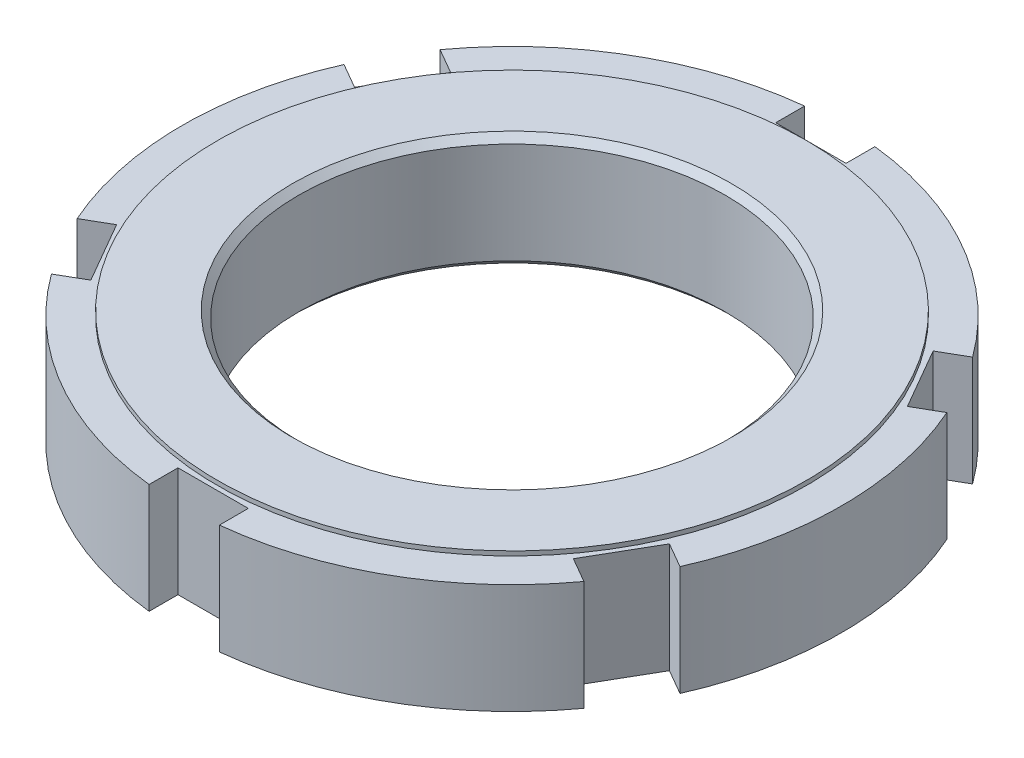
ISO-10303-21;
HEADER;
FILE_DESCRIPTION(('STEP AP214'),'2;1');
FILE_NAME('part.step','',(''),(''),'','','');
FILE_SCHEMA(('AUTOMOTIVE_DESIGN { 1 0 10303 214 1 1 1 1 }'));
ENDSEC;
DATA;
#1=APPLICATION_CONTEXT('core data for automotive mechanical design processes');
#2=APPLICATION_PROTOCOL_DEFINITION('international standard','automotive_design',2000,#1);
#3=PRODUCT_CONTEXT('',#1,'mechanical');
#4=PRODUCT('Part','Part','',(#3));
#5=PRODUCT_RELATED_PRODUCT_CATEGORY('part','',(#4));
#6=PRODUCT_DEFINITION_FORMATION('','',#4);
#7=PRODUCT_DEFINITION_CONTEXT('part definition',#1,'design');
#8=PRODUCT_DEFINITION('design','',#6,#7);
#9=PRODUCT_DEFINITION_SHAPE('','',#8);
#10=(LENGTH_UNIT() NAMED_UNIT(*) SI_UNIT(.MILLI.,.METRE.));
#11=(NAMED_UNIT(*) PLANE_ANGLE_UNIT() SI_UNIT($,.RADIAN.));
#12=(NAMED_UNIT(*) SI_UNIT($,.STERADIAN.) SOLID_ANGLE_UNIT());
#13=UNCERTAINTY_MEASURE_WITH_UNIT(LENGTH_MEASURE(1.E-05),#10,'distance_accuracy_value','');
#14=(GEOMETRIC_REPRESENTATION_CONTEXT(3) GLOBAL_UNCERTAINTY_ASSIGNED_CONTEXT((#13)) GLOBAL_UNIT_ASSIGNED_CONTEXT((#10,
#11,#12)) REPRESENTATION_CONTEXT('',''));
#15=CARTESIAN_POINT('',(0.,0.,0.));
#16=DIRECTION('',(0.,0.,1.));
#17=DIRECTION('',(1.,0.,0.));
#18=AXIS2_PLACEMENT_3D('',#15,#16,#17);
#19=CARTESIAN_POINT('',(0.,13.,0.));
#20=DIRECTION('',(0.,1.,0.));
#21=DIRECTION('',(0.,0.,1.));
#22=AXIS2_PLACEMENT_3D('',#19,#20,#21);
#23=PLANE('',#22);
#24=CARTESIAN_POINT('',(0.,13.,0.));
#25=DIRECTION('',(0.,1.,0.));
#26=DIRECTION('',(-1.,0.,0.));
#27=AXIS2_PLACEMENT_3D('',#24,#25,#26);
#28=CIRCLE('',#27,25.);
#29=CARTESIAN_POINT('',(-25.,13.,0.));
#30=VERTEX_POINT('',#29);
#31=EDGE_CURVE('E311',#30,#30,#28,.F.);
#32=ORIENTED_EDGE('',*,*,#31,.T.);
#33=EDGE_LOOP('',(#32));
#34=FACE_BOUND('',#33,.T.);
#35=CARTESIAN_POINT('',(0.,13.,0.));
#36=DIRECTION('',(0.,-1.,0.));
#37=DIRECTION('',(0.,0.,-1.));
#38=AXIS2_PLACEMENT_3D('',#35,#36,#37);
#39=CIRCLE('',#38,33.5);
#40=CARTESIAN_POINT('',(0.,13.,-33.5));
#41=VERTEX_POINT('',#40);
#42=EDGE_CURVE('E19',#41,#41,#39,.T.);
#43=ORIENTED_EDGE('',*,*,#42,.F.);
#44=EDGE_LOOP('',(#43));
#45=FACE_BOUND('',#44,.T.);
#46=ADVANCED_FACE('F16',(#34,#45),#23,.T.);
#47=CARTESIAN_POINT('',(0.,12.5,0.));
#48=DIRECTION('',(0.,-1.,0.));
#49=DIRECTION('',(0.,0.,-1.));
#50=AXIS2_PLACEMENT_3D('',#47,#48,#49);
#51=CYLINDRICAL_SURFACE('',#50,33.5);
#52=CARTESIAN_POINT('',(0.,12.5,0.));
#53=DIRECTION('',(0.,-1.,0.));
#54=DIRECTION('',(0.,0.,-1.));
#55=AXIS2_PLACEMENT_3D('',#52,#53,#54);
#56=CIRCLE('',#55,33.5);
#57=CARTESIAN_POINT('',(0.,12.5,-33.5));
#58=VERTEX_POINT('',#57);
#59=EDGE_CURVE('E268',#58,#58,#56,.T.);
#60=ORIENTED_EDGE('',*,*,#59,.F.);
#61=EDGE_LOOP('',(#60));
#62=FACE_BOUND('',#61,.T.);
#63=ORIENTED_EDGE('',*,*,#42,.T.);
#64=EDGE_LOOP('',(#63));
#65=FACE_BOUND('',#64,.T.);
#66=ADVANCED_FACE('F318',(#62,#65),#51,.T.);
#67=CARTESIAN_POINT('',(0.,13.,0.));
#68=DIRECTION('',(0.,1.,0.));
#69=DIRECTION('',(-1.,0.,0.));
#70=AXIS2_PLACEMENT_3D('',#67,#68,#69);
#71=CONICAL_SURFACE('',#70,25.,0.785398163397444);
#72=CARTESIAN_POINT('',(0.,12.25,0.));
#73=DIRECTION('',(0.,1.,0.));
#74=DIRECTION('',(0.,0.,1.));
#75=AXIS2_PLACEMENT_3D('',#72,#73,#74);
#76=CIRCLE('',#75,24.25);
#77=CARTESIAN_POINT('',(0.,12.25,24.25));
#78=VERTEX_POINT('',#77);
#79=EDGE_CURVE('E150',#78,#78,#76,.F.);
#80=ORIENTED_EDGE('',*,*,#79,.T.);
#81=EDGE_LOOP('',(#80));
#82=FACE_BOUND('',#81,.T.);
#83=ORIENTED_EDGE('',*,*,#31,.F.);
#84=EDGE_LOOP('',(#83));
#85=FACE_BOUND('',#84,.T.);
#86=ADVANCED_FACE('F325',(#82,#85),#71,.F.);
#87=CARTESIAN_POINT('',(0.,12.5,0.));
#88=DIRECTION('',(0.,1.,0.));
#89=DIRECTION('',(0.,0.,1.));
#90=AXIS2_PLACEMENT_3D('',#87,#88,#89);
#91=PLANE('',#90);
#92=ORIENTED_EDGE('',*,*,#59,.T.);
#93=EDGE_LOOP('',(#92));
#94=FACE_BOUND('',#93,.T.);
#95=DIRECTION('',(-0.866025403784439,0.,0.499999999999999));
#96=VECTOR('',#95,1.);
#97=CARTESIAN_POINT('',(30.2906720276925,12.5,-22.1071298026399));
#98=LINE('',#97,#96);
#99=CARTESIAN_POINT('',(27.4448637286709,12.5,-20.4641016151378));
#100=VERTEX_POINT('',#99);
#101=CARTESIAN_POINT('',(30.2906720276925,12.5,-22.1071298026399));
#102=VERTEX_POINT('',#101);
#103=EDGE_CURVE('E171',#100,#102,#98,.F.);
#104=ORIENTED_EDGE('',*,*,#103,.T.);
#105=CARTESIAN_POINT('',(0.,12.5,0.));
#106=DIRECTION('',(0.,1.,0.));
#107=DIRECTION('',(0.,0.,1.));
#108=AXIS2_PLACEMENT_3D('',#105,#106,#107);
#109=CIRCLE('',#108,37.5);
#110=CARTESIAN_POINT('',(4.00000000000002,12.5,-37.2860563750043));
#111=VERTEX_POINT('',#110);
#112=EDGE_CURVE('E158',#111,#102,#109,.F.);
#113=ORIENTED_EDGE('',*,*,#112,.F.);
#114=DIRECTION('',(0.,0.,-1.));
#115=VECTOR('',#114,1.);
#116=CARTESIAN_POINT('',(4.00000000000002,12.5,-37.2860563750043));
#117=LINE('',#116,#115);
#118=CARTESIAN_POINT('',(4.00000000000001,12.5,-34.));
#119=VERTEX_POINT('',#118);
#120=EDGE_CURVE('E153',#111,#119,#117,.F.);
#121=ORIENTED_EDGE('',*,*,#120,.T.);
#122=DIRECTION('',(1.,0.,0.));
#123=VECTOR('',#122,1.);
#124=CARTESIAN_POINT('',(-4.00000000000001,12.5,-34.));
#125=LINE('',#124,#123);
#126=CARTESIAN_POINT('',(-4.00000000000001,12.5,-34.));
#127=VERTEX_POINT('',#126);
#128=EDGE_CURVE('E138',#119,#127,#125,.F.);
#129=ORIENTED_EDGE('',*,*,#128,.T.);
#130=DIRECTION('',(0.,0.,1.));
#131=VECTOR('',#130,1.);
#132=CARTESIAN_POINT('',(-4.00000000000001,12.5,-37.2860563750043));
#133=LINE('',#132,#131);
#134=CARTESIAN_POINT('',(-4.,12.5,-37.2860563750043));
#135=VERTEX_POINT('',#134);
#136=EDGE_CURVE('E263',#127,#135,#133,.F.);
#137=ORIENTED_EDGE('',*,*,#136,.T.);
#138=CARTESIAN_POINT('',(0.,12.5,0.));
#139=DIRECTION('',(0.,1.,0.));
#140=DIRECTION('',(0.,0.,1.));
#141=AXIS2_PLACEMENT_3D('',#138,#139,#140);
#142=CIRCLE('',#141,37.5);
#143=CARTESIAN_POINT('',(-30.2906720276925,12.5,-22.1071298026399));
#144=VERTEX_POINT('',#143);
#145=EDGE_CURVE('E128',#144,#135,#142,.F.);
#146=ORIENTED_EDGE('',*,*,#145,.F.);
#147=DIRECTION('',(-0.866025403784434,0.,-0.500000000000007));
#148=VECTOR('',#147,1.);
#149=CARTESIAN_POINT('',(-30.2906720276925,12.5,-22.1071298026399));
#150=LINE('',#149,#148);
#151=CARTESIAN_POINT('',(-27.4448637286709,12.5,-20.4641016151377));
#152=VERTEX_POINT('',#151);
#153=EDGE_CURVE('E258',#144,#152,#150,.F.);
#154=ORIENTED_EDGE('',*,*,#153,.T.);
#155=DIRECTION('',(0.499999999999999,0.,-0.866025403784439));
#156=VECTOR('',#155,1.);
#157=CARTESIAN_POINT('',(-31.4448637286709,12.5,-13.5358983848622));
#158=LINE('',#157,#156);
#159=CARTESIAN_POINT('',(-31.4448637286709,12.5,-13.5358983848622));
#160=VERTEX_POINT('',#159);
#161=EDGE_CURVE('E252',#152,#160,#158,.F.);
#162=ORIENTED_EDGE('',*,*,#161,.T.);
#163=DIRECTION('',(0.866025403784439,0.,0.499999999999999));
#164=VECTOR('',#163,1.);
#165=CARTESIAN_POINT('',(-34.2906720276925,12.5,-15.1789265723644));
#166=LINE('',#165,#164);
#167=CARTESIAN_POINT('',(-34.2906720276925,12.5,-15.1789265723644));
#168=VERTEX_POINT('',#167);
#169=EDGE_CURVE('E245',#160,#168,#166,.F.);
#170=ORIENTED_EDGE('',*,*,#169,.T.);
#171=CARTESIAN_POINT('',(0.,12.5,0.));
#172=DIRECTION('',(0.,1.,0.));
#173=DIRECTION('',(0.,0.,1.));
#174=AXIS2_PLACEMENT_3D('',#171,#172,#173);
#175=CIRCLE('',#174,37.5);
#176=CARTESIAN_POINT('',(-34.2906720276925,12.5,15.1789265723644));
#177=VERTEX_POINT('',#176);
#178=EDGE_CURVE('E248',#177,#168,#175,.F.);
#179=ORIENTED_EDGE('',*,*,#178,.F.);
#180=DIRECTION('',(-0.866025403784444,0.,0.499999999999992));
#181=VECTOR('',#180,1.);
#182=CARTESIAN_POINT('',(-34.2906720276925,12.5,15.1789265723644));
#183=LINE('',#182,#181);
#184=CARTESIAN_POINT('',(-31.4448637286709,12.5,13.5358983848623));
#185=VERTEX_POINT('',#184);
#186=EDGE_CURVE('E239',#177,#185,#183,.F.);
#187=ORIENTED_EDGE('',*,*,#186,.T.);
#188=DIRECTION('',(-0.500000000000001,0.,-0.866025403784438));
#189=VECTOR('',#188,1.);
#190=CARTESIAN_POINT('',(-27.4448637286709,12.5,20.4641016151378));
#191=LINE('',#190,#189);
#192=CARTESIAN_POINT('',(-27.4448637286709,12.5,20.4641016151378));
#193=VERTEX_POINT('',#192);
#194=EDGE_CURVE('E233',#185,#193,#191,.F.);
#195=ORIENTED_EDGE('',*,*,#194,.T.);
#196=DIRECTION('',(0.866025403784438,0.,-0.500000000000001));
#197=VECTOR('',#196,1.);
#198=CARTESIAN_POINT('',(-30.2906720276924,12.5,22.1071298026399));
#199=LINE('',#198,#197);
#200=CARTESIAN_POINT('',(-30.2906720276925,12.5,22.1071298026399));
#201=VERTEX_POINT('',#200);
#202=EDGE_CURVE('E226',#193,#201,#199,.F.);
#203=ORIENTED_EDGE('',*,*,#202,.T.);
#204=CARTESIAN_POINT('',(0.,12.5,0.));
#205=DIRECTION('',(0.,1.,0.));
#206=DIRECTION('',(0.,0.,1.));
#207=AXIS2_PLACEMENT_3D('',#204,#205,#206);
#208=CIRCLE('',#207,37.5);
#209=CARTESIAN_POINT('',(-4.00000000000002,12.5,37.2860563750043));
#210=VERTEX_POINT('',#209);
#211=EDGE_CURVE('E229',#210,#201,#208,.F.);
#212=ORIENTED_EDGE('',*,*,#211,.F.);
#213=DIRECTION('',(0.,0.,1.));
#214=VECTOR('',#213,1.);
#215=CARTESIAN_POINT('',(-4.00000000000002,12.5,37.2860563750043));
#216=LINE('',#215,#214);
#217=CARTESIAN_POINT('',(-3.99999999999999,12.5,34.));
#218=VERTEX_POINT('',#217);
#219=EDGE_CURVE('E220',#210,#218,#216,.F.);
#220=ORIENTED_EDGE('',*,*,#219,.T.);
#221=DIRECTION('',(-1.,0.,0.));
#222=VECTOR('',#221,1.);
#223=CARTESIAN_POINT('',(4.00000000000001,12.5,34.));
#224=LINE('',#223,#222);
#225=CARTESIAN_POINT('',(4.00000000000001,12.5,34.));
#226=VERTEX_POINT('',#225);
#227=EDGE_CURVE('E214',#218,#226,#224,.F.);
#228=ORIENTED_EDGE('',*,*,#227,.T.);
#229=DIRECTION('',(0.,0.,-1.));
#230=VECTOR('',#229,1.);
#231=CARTESIAN_POINT('',(4.00000000000002,12.5,37.2860563750043));
#232=LINE('',#231,#230);
#233=CARTESIAN_POINT('',(4.00000000000002,12.5,37.2860563750043));
#234=VERTEX_POINT('',#233);
#235=EDGE_CURVE('E207',#226,#234,#232,.F.);
#236=ORIENTED_EDGE('',*,*,#235,.T.);
#237=CARTESIAN_POINT('',(0.,12.5,0.));
#238=DIRECTION('',(0.,1.,0.));
#239=DIRECTION('',(0.,0.,1.));
#240=AXIS2_PLACEMENT_3D('',#237,#238,#239);
#241=CIRCLE('',#240,37.5);
#242=CARTESIAN_POINT('',(30.2906720276925,12.5,22.1071298026399));
#243=VERTEX_POINT('',#242);
#244=EDGE_CURVE('E210',#243,#234,#241,.F.);
#245=ORIENTED_EDGE('',*,*,#244,.F.);
#246=DIRECTION('',(0.866025403784434,0.,0.500000000000008));
#247=VECTOR('',#246,1.);
#248=CARTESIAN_POINT('',(30.2906720276925,12.5,22.1071298026399));
#249=LINE('',#248,#247);
#250=CARTESIAN_POINT('',(27.4448637286709,12.5,20.4641016151377));
#251=VERTEX_POINT('',#250);
#252=EDGE_CURVE('E201',#243,#251,#249,.F.);
#253=ORIENTED_EDGE('',*,*,#252,.T.);
#254=DIRECTION('',(-0.5,0.,0.866025403784439));
#255=VECTOR('',#254,1.);
#256=CARTESIAN_POINT('',(31.4448637286709,12.5,13.5358983848622));
#257=LINE('',#256,#255);
#258=CARTESIAN_POINT('',(31.4448637286709,12.5,13.5358983848622));
#259=VERTEX_POINT('',#258);
#260=EDGE_CURVE('E195',#251,#259,#257,.F.);
#261=ORIENTED_EDGE('',*,*,#260,.T.);
#262=DIRECTION('',(-0.866025403784439,0.,-0.499999999999999));
#263=VECTOR('',#262,1.);
#264=CARTESIAN_POINT('',(34.2906720276925,12.5,15.1789265723644));
#265=LINE('',#264,#263);
#266=CARTESIAN_POINT('',(34.2906720276925,12.5,15.1789265723644));
#267=VERTEX_POINT('',#266);
#268=EDGE_CURVE('E188',#259,#267,#265,.F.);
#269=ORIENTED_EDGE('',*,*,#268,.T.);
#270=CARTESIAN_POINT('',(0.,12.5,0.));
#271=DIRECTION('',(0.,1.,0.));
#272=DIRECTION('',(0.,0.,1.));
#273=AXIS2_PLACEMENT_3D('',#270,#271,#272);
#274=CIRCLE('',#273,37.5);
#275=CARTESIAN_POINT('',(34.2906720276925,12.5,-15.1789265723644));
#276=VERTEX_POINT('',#275);
#277=EDGE_CURVE('E191',#276,#267,#274,.F.);
#278=ORIENTED_EDGE('',*,*,#277,.F.);
#279=DIRECTION('',(0.866025403784444,0.,-0.49999999999999));
#280=VECTOR('',#279,1.);
#281=CARTESIAN_POINT('',(34.2906720276925,12.5,-15.1789265723644));
#282=LINE('',#281,#280);
#283=CARTESIAN_POINT('',(31.4448637286709,12.5,-13.5358983848623));
#284=VERTEX_POINT('',#283);
#285=EDGE_CURVE('E182',#276,#284,#282,.F.);
#286=ORIENTED_EDGE('',*,*,#285,.T.);
#287=DIRECTION('',(0.5,0.,0.866025403784439));
#288=VECTOR('',#287,1.);
#289=CARTESIAN_POINT('',(27.4448637286709,12.5,-20.4641016151378));
#290=LINE('',#289,#288);
#291=EDGE_CURVE('E176',#284,#100,#290,.F.);
#292=ORIENTED_EDGE('',*,*,#291,.T.);
#293=EDGE_LOOP('',(#104,#113,#121,#129,#137,#146,#154,#162,#170,#179,#187,#195,#203,#212,#220,
#228,#236,#245,#253,#261,#269,#278,#286,#292));
#294=FACE_BOUND('',#293,.T.);
#295=ADVANCED_FACE('F157',(#94,#294),#91,.T.);
#296=CARTESIAN_POINT('',(0.,13.,0.));
#297=DIRECTION('',(0.,1.,0.));
#298=DIRECTION('',(0.,0.,1.));
#299=AXIS2_PLACEMENT_3D('',#296,#297,#298);
#300=CYLINDRICAL_SURFACE('',#299,24.25);
#301=ORIENTED_EDGE('',*,*,#79,.F.);
#302=EDGE_LOOP('',(#301));
#303=FACE_BOUND('',#302,.T.);
#304=CARTESIAN_POINT('',(0.,0.749999999999994,0.));
#305=DIRECTION('',(0.,-1.,0.));
#306=DIRECTION('',(0.,0.,-1.));
#307=AXIS2_PLACEMENT_3D('',#304,#305,#306);
#308=CIRCLE('',#307,24.25);
#309=CARTESIAN_POINT('',(0.,0.749999999999992,-24.25));
#310=VERTEX_POINT('',#309);
#311=EDGE_CURVE('E159',#310,#310,#308,.T.);
#312=ORIENTED_EDGE('',*,*,#311,.T.);
#313=EDGE_LOOP('',(#312));
#314=FACE_BOUND('',#313,.T.);
#315=ADVANCED_FACE('F431',(#303,#314),#300,.F.);
#316=CARTESIAN_POINT('',(-4.00000000000001,13.,-34.));
#317=DIRECTION('',(0.,0.,1.));
#318=DIRECTION('',(1.,0.,0.));
#319=AXIS2_PLACEMENT_3D('',#316,#317,#318);
#320=PLANE('',#319);
#321=DIRECTION('',(0.,1.,0.));
#322=VECTOR('',#321,1.);
#323=CARTESIAN_POINT('',(4.00000000000002,13.,-34.));
#324=LINE('',#323,#322);
#325=CARTESIAN_POINT('',(4.00000000000002,0.,-34.));
#326=VERTEX_POINT('',#325);
#327=EDGE_CURVE('E147',#119,#326,#324,.F.);
#328=ORIENTED_EDGE('',*,*,#327,.T.);
#329=DIRECTION('',(1.,0.,0.));
#330=VECTOR('',#329,1.);
#331=CARTESIAN_POINT('',(0.,0.,-34.));
#332=LINE('',#331,#330);
#333=CARTESIAN_POINT('',(-4.00000000000001,0.,-34.));
#334=VERTEX_POINT('',#333);
#335=EDGE_CURVE('E162',#326,#334,#332,.F.);
#336=ORIENTED_EDGE('',*,*,#335,.T.);
#337=DIRECTION('',(0.,1.,0.));
#338=VECTOR('',#337,1.);
#339=CARTESIAN_POINT('',(-4.00000000000001,13.,-34.));
#340=LINE('',#339,#338);
#341=EDGE_CURVE('E149',#334,#127,#340,.T.);
#342=ORIENTED_EDGE('',*,*,#341,.T.);
#343=ORIENTED_EDGE('',*,*,#128,.F.);
#344=EDGE_LOOP('',(#328,#336,#342,#343));
#345=FACE_BOUND('',#344,.T.);
#346=ADVANCED_FACE('F145',(#345),#320,.F.);
#347=CARTESIAN_POINT('',(-4.00000000000001,13.,-37.2860563750043));
#348=DIRECTION('',(-1.,0.,0.));
#349=DIRECTION('',(0.,0.,1.));
#350=AXIS2_PLACEMENT_3D('',#347,#348,#349);
#351=PLANE('',#350);
#352=ORIENTED_EDGE('',*,*,#341,.F.);
#353=DIRECTION('',(0.,0.,1.));
#354=VECTOR('',#353,1.);
#355=CARTESIAN_POINT('',(-4.00000000000001,0.,0.));
#356=LINE('',#355,#354);
#357=CARTESIAN_POINT('',(-4.,0.,-37.2860563750043));
#358=VERTEX_POINT('',#357);
#359=EDGE_CURVE('E298',#334,#358,#356,.F.);
#360=ORIENTED_EDGE('',*,*,#359,.T.);
#361=DIRECTION('',(0.,1.,0.));
#362=VECTOR('',#361,1.);
#363=CARTESIAN_POINT('',(-3.99999999999999,13.,-37.2860563750043));
#364=LINE('',#363,#362);
#365=EDGE_CURVE('E309',#135,#358,#364,.F.);
#366=ORIENTED_EDGE('',*,*,#365,.F.);
#367=ORIENTED_EDGE('',*,*,#136,.F.);
#368=EDGE_LOOP('',(#352,#360,#366,#367));
#369=FACE_BOUND('',#368,.T.);
#370=ADVANCED_FACE('F425',(#369),#351,.F.);
#371=CARTESIAN_POINT('',(0.,13.,0.));
#372=DIRECTION('',(0.,1.,0.));
#373=DIRECTION('',(0.,0.,1.));
#374=AXIS2_PLACEMENT_3D('',#371,#372,#373);
#375=CYLINDRICAL_SURFACE('',#374,37.5);
#376=CARTESIAN_POINT('',(0.,0.,0.));
#377=DIRECTION('',(0.,1.,0.));
#378=DIRECTION('',(0.,0.,1.));
#379=AXIS2_PLACEMENT_3D('',#376,#377,#378);
#380=CIRCLE('',#379,37.5);
#381=CARTESIAN_POINT('',(-30.2906720276925,0.,-22.1071298026399));
#382=VERTEX_POINT('',#381);
#383=EDGE_CURVE('E294',#358,#382,#380,.T.);
#384=ORIENTED_EDGE('',*,*,#383,.T.);
#385=DIRECTION('',(0.,1.,0.));
#386=VECTOR('',#385,1.);
#387=CARTESIAN_POINT('',(-30.2906720276925,13.,-22.1071298026399));
#388=LINE('',#387,#386);
#389=EDGE_CURVE('E260',#382,#144,#388,.T.);
#390=ORIENTED_EDGE('',*,*,#389,.T.);
#391=ORIENTED_EDGE('',*,*,#145,.T.);
#392=ORIENTED_EDGE('',*,*,#365,.T.);
#393=EDGE_LOOP('',(#384,#390,#391,#392));
#394=FACE_BOUND('',#393,.T.);
#395=ADVANCED_FACE('F421',(#394),#375,.T.);
#396=CARTESIAN_POINT('',(-30.2906720276925,13.,-22.1071298026399));
#397=DIRECTION('',(0.500000000000007,0.,-0.866025403784434));
#398=DIRECTION('',(-0.866025403784434,0.,-0.500000000000007));
#399=AXIS2_PLACEMENT_3D('',#396,#397,#398);
#400=PLANE('',#399);
#401=ORIENTED_EDGE('',*,*,#389,.F.);
#402=DIRECTION('',(0.866025403784436,0.,0.500000000000004));
#403=VECTOR('',#402,1.);
#404=CARTESIAN_POINT('',(-30.2906720276925,0.,-22.1071298026399));
#405=LINE('',#404,#403);
#406=CARTESIAN_POINT('',(-27.4448637286709,0.,-20.4641016151377));
#407=VERTEX_POINT('',#406);
#408=EDGE_CURVE('E297',#382,#407,#405,.T.);
#409=ORIENTED_EDGE('',*,*,#408,.T.);
#410=DIRECTION('',(0.,1.,0.));
#411=VECTOR('',#410,1.);
#412=CARTESIAN_POINT('',(-27.4448637286709,13.,-20.4641016151377));
#413=LINE('',#412,#411);
#414=EDGE_CURVE('E255',#407,#152,#413,.T.);
#415=ORIENTED_EDGE('',*,*,#414,.T.);
#416=ORIENTED_EDGE('',*,*,#153,.F.);
#417=EDGE_LOOP('',(#401,#409,#415,#416));
#418=FACE_BOUND('',#417,.T.);
#419=ADVANCED_FACE('F417',(#418),#400,.F.);
#420=CARTESIAN_POINT('',(-31.4448637286709,13.,-13.5358983848622));
#421=DIRECTION('',(0.866025403784439,0.,0.499999999999999));
#422=DIRECTION('',(0.499999999999999,0.,-0.866025403784439));
#423=AXIS2_PLACEMENT_3D('',#420,#421,#422);
#424=PLANE('',#423);
#425=ORIENTED_EDGE('',*,*,#414,.F.);
#426=DIRECTION('',(-0.499999999999999,0.,0.866025403784439));
#427=VECTOR('',#426,1.);
#428=CARTESIAN_POINT('',(-27.4448637286709,0.,-20.4641016151377));
#429=LINE('',#428,#427);
#430=CARTESIAN_POINT('',(-31.4448637286709,0.,-13.5358983848622));
#431=VERTEX_POINT('',#430);
#432=EDGE_CURVE('E920',#407,#431,#429,.T.);
#433=ORIENTED_EDGE('',*,*,#432,.T.);
#434=DIRECTION('',(0.,1.,0.));
#435=VECTOR('',#434,1.);
#436=CARTESIAN_POINT('',(-31.4448637286709,13.,-13.5358983848622));
#437=LINE('',#436,#435);
#438=EDGE_CURVE('E249',#431,#160,#437,.T.);
#439=ORIENTED_EDGE('',*,*,#438,.T.);
#440=ORIENTED_EDGE('',*,*,#161,.F.);
#441=EDGE_LOOP('',(#425,#433,#439,#440));
#442=FACE_BOUND('',#441,.T.);
#443=ADVANCED_FACE('F413',(#442),#424,.F.);
#444=CARTESIAN_POINT('',(-34.2906720276925,13.,-15.1789265723644));
#445=DIRECTION('',(-0.499999999999999,0.,0.866025403784439));
#446=DIRECTION('',(0.866025403784439,0.,0.499999999999999));
#447=AXIS2_PLACEMENT_3D('',#444,#445,#446);
#448=PLANE('',#447);
#449=ORIENTED_EDGE('',*,*,#438,.F.);
#450=DIRECTION('',(-0.866025403784439,0.,-0.499999999999999));
#451=VECTOR('',#450,1.);
#452=CARTESIAN_POINT('',(-31.4448637286709,0.,-13.5358983848622));
#453=LINE('',#452,#451);
#454=CARTESIAN_POINT('',(-34.2906720276925,0.,-15.1789265723644));
#455=VERTEX_POINT('',#454);
#456=EDGE_CURVE('E293',#431,#455,#453,.T.);
#457=ORIENTED_EDGE('',*,*,#456,.T.);
#458=DIRECTION('',(0.,1.,0.));
#459=VECTOR('',#458,1.);
#460=CARTESIAN_POINT('',(-34.2906720276925,13.,-15.1789265723644));
#461=LINE('',#460,#459);
#462=EDGE_CURVE('E307',#168,#455,#461,.F.);
#463=ORIENTED_EDGE('',*,*,#462,.F.);
#464=ORIENTED_EDGE('',*,*,#169,.F.);
#465=EDGE_LOOP('',(#449,#457,#463,#464));
#466=FACE_BOUND('',#465,.T.);
#467=ADVANCED_FACE('F409',(#466),#448,.F.);
#468=CARTESIAN_POINT('',(0.,13.,0.));
#469=DIRECTION('',(0.,1.,0.));
#470=DIRECTION('',(0.,0.,1.));
#471=AXIS2_PLACEMENT_3D('',#468,#469,#470);
#472=CYLINDRICAL_SURFACE('',#471,37.5);
#473=CARTESIAN_POINT('',(0.,0.,0.));
#474=DIRECTION('',(0.,1.,0.));
#475=DIRECTION('',(0.,0.,1.));
#476=AXIS2_PLACEMENT_3D('',#473,#474,#475);
#477=CIRCLE('',#476,37.5);
#478=CARTESIAN_POINT('',(-34.2906720276925,0.,15.1789265723644));
#479=VERTEX_POINT('',#478);
#480=EDGE_CURVE('E289',#455,#479,#477,.T.);
#481=ORIENTED_EDGE('',*,*,#480,.T.);
#482=DIRECTION('',(0.,1.,0.));
#483=VECTOR('',#482,1.);
#484=CARTESIAN_POINT('',(-34.2906720276925,13.,15.1789265723644));
#485=LINE('',#484,#483);
#486=EDGE_CURVE('E242',#479,#177,#485,.T.);
#487=ORIENTED_EDGE('',*,*,#486,.T.);
#488=ORIENTED_EDGE('',*,*,#178,.T.);
#489=ORIENTED_EDGE('',*,*,#462,.T.);
#490=EDGE_LOOP('',(#481,#487,#488,#489));
#491=FACE_BOUND('',#490,.T.);
#492=ADVANCED_FACE('F405',(#491),#472,.T.);
#493=CARTESIAN_POINT('',(-34.2906720276925,13.,15.1789265723644));
#494=DIRECTION('',(-0.499999999999992,0.,-0.866025403784444));
#495=DIRECTION('',(-0.866025403784444,0.,0.499999999999992));
#496=AXIS2_PLACEMENT_3D('',#493,#494,#495);
#497=PLANE('',#496);
#498=ORIENTED_EDGE('',*,*,#486,.F.);
#499=DIRECTION('',(0.866025403784446,0.,-0.499999999999987));
#500=VECTOR('',#499,1.);
#501=CARTESIAN_POINT('',(-34.2906720276925,0.,15.1789265723644));
#502=LINE('',#501,#500);
#503=CARTESIAN_POINT('',(-31.4448637286709,0.,13.5358983848623));
#504=VERTEX_POINT('',#503);
#505=EDGE_CURVE('E292',#479,#504,#502,.T.);
#506=ORIENTED_EDGE('',*,*,#505,.T.);
#507=DIRECTION('',(0.,1.,0.));
#508=VECTOR('',#507,1.);
#509=CARTESIAN_POINT('',(-31.4448637286709,13.,13.5358983848623));
#510=LINE('',#509,#508);
#511=EDGE_CURVE('E236',#504,#185,#510,.T.);
#512=ORIENTED_EDGE('',*,*,#511,.T.);
#513=ORIENTED_EDGE('',*,*,#186,.F.);
#514=EDGE_LOOP('',(#498,#506,#512,#513));
#515=FACE_BOUND('',#514,.T.);
#516=ADVANCED_FACE('F401',(#515),#497,.F.);
#517=CARTESIAN_POINT('',(-27.4448637286709,13.,20.4641016151378));
#518=DIRECTION('',(0.866025403784438,0.,-0.500000000000001));
#519=DIRECTION('',(-0.500000000000001,0.,-0.866025403784438));
#520=AXIS2_PLACEMENT_3D('',#517,#518,#519);
#521=PLANE('',#520);
#522=ORIENTED_EDGE('',*,*,#511,.F.);
#523=DIRECTION('',(0.5,0.,0.866025403784439));
#524=VECTOR('',#523,1.);
#525=CARTESIAN_POINT('',(-31.4448637286709,0.,13.5358983848623));
#526=LINE('',#525,#524);
#527=CARTESIAN_POINT('',(-27.4448637286709,0.,20.4641016151378));
#528=VERTEX_POINT('',#527);
#529=EDGE_CURVE('E904',#504,#528,#526,.T.);
#530=ORIENTED_EDGE('',*,*,#529,.T.);
#531=DIRECTION('',(0.,1.,0.));
#532=VECTOR('',#531,1.);
#533=CARTESIAN_POINT('',(-27.4448637286709,13.,20.4641016151378));
#534=LINE('',#533,#532);
#535=EDGE_CURVE('E230',#528,#193,#534,.T.);
#536=ORIENTED_EDGE('',*,*,#535,.T.);
#537=ORIENTED_EDGE('',*,*,#194,.F.);
#538=EDGE_LOOP('',(#522,#530,#536,#537));
#539=FACE_BOUND('',#538,.T.);
#540=ADVANCED_FACE('F397',(#539),#521,.F.);
#541=CARTESIAN_POINT('',(-30.2906720276924,13.,22.1071298026399));
#542=DIRECTION('',(0.500000000000001,0.,0.866025403784438));
#543=DIRECTION('',(0.866025403784438,0.,-0.500000000000001));
#544=AXIS2_PLACEMENT_3D('',#541,#542,#543);
#545=PLANE('',#544);
#546=ORIENTED_EDGE('',*,*,#535,.F.);
#547=DIRECTION('',(-0.866025403784438,0.,0.500000000000001));
#548=VECTOR('',#547,1.);
#549=CARTESIAN_POINT('',(-27.4448637286709,0.,20.4641016151378));
#550=LINE('',#549,#548);
#551=CARTESIAN_POINT('',(-30.2906720276925,0.,22.1071298026399));
#552=VERTEX_POINT('',#551);
#553=EDGE_CURVE('E288',#528,#552,#550,.T.);
#554=ORIENTED_EDGE('',*,*,#553,.T.);
#555=DIRECTION('',(0.,1.,0.));
#556=VECTOR('',#555,1.);
#557=CARTESIAN_POINT('',(-30.2906720276925,13.,22.1071298026399));
#558=LINE('',#557,#556);
#559=EDGE_CURVE('E305',#201,#552,#558,.F.);
#560=ORIENTED_EDGE('',*,*,#559,.F.);
#561=ORIENTED_EDGE('',*,*,#202,.F.);
#562=EDGE_LOOP('',(#546,#554,#560,#561));
#563=FACE_BOUND('',#562,.T.);
#564=ADVANCED_FACE('F393',(#563),#545,.F.);
#565=CARTESIAN_POINT('',(0.,13.,0.));
#566=DIRECTION('',(0.,1.,0.));
#567=DIRECTION('',(0.,0.,1.));
#568=AXIS2_PLACEMENT_3D('',#565,#566,#567);
#569=CYLINDRICAL_SURFACE('',#568,37.5);
#570=CARTESIAN_POINT('',(0.,0.,0.));
#571=DIRECTION('',(0.,1.,0.));
#572=DIRECTION('',(0.,0.,1.));
#573=AXIS2_PLACEMENT_3D('',#570,#571,#572);
#574=CIRCLE('',#573,37.5);
#575=CARTESIAN_POINT('',(-4.00000000000003,0.,37.2860563750043));
#576=VERTEX_POINT('',#575);
#577=EDGE_CURVE('E284',#552,#576,#574,.T.);
#578=ORIENTED_EDGE('',*,*,#577,.T.);
#579=DIRECTION('',(0.,1.,0.));
#580=VECTOR('',#579,1.);
#581=CARTESIAN_POINT('',(-4.00000000000002,13.,37.2860563750043));
#582=LINE('',#581,#580);
#583=EDGE_CURVE('E223',#576,#210,#582,.T.);
#584=ORIENTED_EDGE('',*,*,#583,.T.);
#585=ORIENTED_EDGE('',*,*,#211,.T.);
#586=ORIENTED_EDGE('',*,*,#559,.T.);
#587=EDGE_LOOP('',(#578,#584,#585,#586));
#588=FACE_BOUND('',#587,.T.);
#589=ADVANCED_FACE('F389',(#588),#569,.T.);
#590=CARTESIAN_POINT('',(-4.00000000000002,13.,37.2860563750043));
#591=DIRECTION('',(-1.,0.,0.));
#592=DIRECTION('',(0.,0.,1.));
#593=AXIS2_PLACEMENT_3D('',#590,#591,#592);
#594=PLANE('',#593);
#595=ORIENTED_EDGE('',*,*,#583,.F.);
#596=DIRECTION('',(0.,0.,1.));
#597=VECTOR('',#596,1.);
#598=CARTESIAN_POINT('',(-4.00000000000004,0.,0.));
#599=LINE('',#598,#597);
#600=CARTESIAN_POINT('',(-4.00000000000002,0.,34.));
#601=VERTEX_POINT('',#600);
#602=EDGE_CURVE('E287',#576,#601,#599,.F.);
#603=ORIENTED_EDGE('',*,*,#602,.T.);
#604=DIRECTION('',(0.,1.,0.));
#605=VECTOR('',#604,1.);
#606=CARTESIAN_POINT('',(-3.99999999999999,13.,34.));
#607=LINE('',#606,#605);
#608=EDGE_CURVE('E217',#601,#218,#607,.T.);
#609=ORIENTED_EDGE('',*,*,#608,.T.);
#610=ORIENTED_EDGE('',*,*,#219,.F.);
#611=EDGE_LOOP('',(#595,#603,#609,#610));
#612=FACE_BOUND('',#611,.T.);
#613=ADVANCED_FACE('F385',(#612),#594,.F.);
#614=CARTESIAN_POINT('',(4.00000000000001,13.,34.));
#615=DIRECTION('',(0.,0.,-1.));
#616=DIRECTION('',(-1.,0.,0.));
#617=AXIS2_PLACEMENT_3D('',#614,#615,#616);
#618=PLANE('',#617);
#619=ORIENTED_EDGE('',*,*,#608,.F.);
#620=DIRECTION('',(1.,0.,0.));
#621=VECTOR('',#620,1.);
#622=CARTESIAN_POINT('',(0.,0.,34.));
#623=LINE('',#622,#621);
#624=CARTESIAN_POINT('',(4.00000000000001,0.,34.));
#625=VERTEX_POINT('',#624);
#626=EDGE_CURVE('E888',#601,#625,#623,.T.);
#627=ORIENTED_EDGE('',*,*,#626,.T.);
#628=DIRECTION('',(0.,1.,0.));
#629=VECTOR('',#628,1.);
#630=CARTESIAN_POINT('',(4.00000000000001,13.,34.));
#631=LINE('',#630,#629);
#632=EDGE_CURVE('E211',#625,#226,#631,.T.);
#633=ORIENTED_EDGE('',*,*,#632,.T.);
#634=ORIENTED_EDGE('',*,*,#227,.F.);
#635=EDGE_LOOP('',(#619,#627,#633,#634));
#636=FACE_BOUND('',#635,.T.);
#637=ADVANCED_FACE('F381',(#636),#618,.F.);
#638=CARTESIAN_POINT('',(4.00000000000002,13.,37.2860563750043));
#639=DIRECTION('',(1.,0.,0.));
#640=DIRECTION('',(0.,0.,-1.));
#641=AXIS2_PLACEMENT_3D('',#638,#639,#640);
#642=PLANE('',#641);
#643=ORIENTED_EDGE('',*,*,#632,.F.);
#644=DIRECTION('',(0.,0.,1.));
#645=VECTOR('',#644,1.);
#646=CARTESIAN_POINT('',(4.00000000000001,0.,0.));
#647=LINE('',#646,#645);
#648=CARTESIAN_POINT('',(4.00000000000002,0.,37.2860563750043));
#649=VERTEX_POINT('',#648);
#650=EDGE_CURVE('E283',#625,#649,#647,.T.);
#651=ORIENTED_EDGE('',*,*,#650,.T.);
#652=DIRECTION('',(0.,1.,0.));
#653=VECTOR('',#652,1.);
#654=CARTESIAN_POINT('',(4.00000000000002,13.,37.2860563750043));
#655=LINE('',#654,#653);
#656=EDGE_CURVE('E303',#234,#649,#655,.F.);
#657=ORIENTED_EDGE('',*,*,#656,.F.);
#658=ORIENTED_EDGE('',*,*,#235,.F.);
#659=EDGE_LOOP('',(#643,#651,#657,#658));
#660=FACE_BOUND('',#659,.T.);
#661=ADVANCED_FACE('F377',(#660),#642,.F.);
#662=CARTESIAN_POINT('',(0.,13.,0.));
#663=DIRECTION('',(0.,1.,0.));
#664=DIRECTION('',(0.,0.,1.));
#665=AXIS2_PLACEMENT_3D('',#662,#663,#664);
#666=CYLINDRICAL_SURFACE('',#665,37.5);
#667=CARTESIAN_POINT('',(0.,0.,0.));
#668=DIRECTION('',(0.,1.,0.));
#669=DIRECTION('',(0.,0.,1.));
#670=AXIS2_PLACEMENT_3D('',#667,#668,#669);
#671=CIRCLE('',#670,37.5);
#672=CARTESIAN_POINT('',(30.2906720276925,0.,22.1071298026399));
#673=VERTEX_POINT('',#672);
#674=EDGE_CURVE('E279',#649,#673,#671,.T.);
#675=ORIENTED_EDGE('',*,*,#674,.T.);
#676=DIRECTION('',(0.,1.,0.));
#677=VECTOR('',#676,1.);
#678=CARTESIAN_POINT('',(30.2906720276925,13.,22.1071298026399));
#679=LINE('',#678,#677);
#680=EDGE_CURVE('E204',#673,#243,#679,.T.);
#681=ORIENTED_EDGE('',*,*,#680,.T.);
#682=ORIENTED_EDGE('',*,*,#244,.T.);
#683=ORIENTED_EDGE('',*,*,#656,.T.);
#684=EDGE_LOOP('',(#675,#681,#682,#683));
#685=FACE_BOUND('',#684,.T.);
#686=ADVANCED_FACE('F373',(#685),#666,.T.);
#687=CARTESIAN_POINT('',(30.2906720276925,13.,22.1071298026399));
#688=DIRECTION('',(-0.500000000000008,0.,0.866025403784434));
#689=DIRECTION('',(0.866025403784434,0.,0.500000000000008));
#690=AXIS2_PLACEMENT_3D('',#687,#688,#689);
#691=PLANE('',#690);
#692=ORIENTED_EDGE('',*,*,#680,.F.);
#693=DIRECTION('',(-0.866025403784434,0.,-0.500000000000008));
#694=VECTOR('',#693,1.);
#695=CARTESIAN_POINT('',(30.2906720276925,0.,22.1071298026399));
#696=LINE('',#695,#694);
#697=CARTESIAN_POINT('',(27.4448637286709,0.,20.4641016151377));
#698=VERTEX_POINT('',#697);
#699=EDGE_CURVE('E282',#673,#698,#696,.T.);
#700=ORIENTED_EDGE('',*,*,#699,.T.);
#701=DIRECTION('',(0.,1.,0.));
#702=VECTOR('',#701,1.);
#703=CARTESIAN_POINT('',(27.4448637286709,13.,20.4641016151377));
#704=LINE('',#703,#702);
#705=EDGE_CURVE('E198',#698,#251,#704,.T.);
#706=ORIENTED_EDGE('',*,*,#705,.T.);
#707=ORIENTED_EDGE('',*,*,#252,.F.);
#708=EDGE_LOOP('',(#692,#700,#706,#707));
#709=FACE_BOUND('',#708,.T.);
#710=ADVANCED_FACE('F369',(#709),#691,.F.);
#711=CARTESIAN_POINT('',(31.4448637286709,13.,13.5358983848622));
#712=DIRECTION('',(-0.866025403784439,0.,-0.5));
#713=DIRECTION('',(-0.5,0.,0.866025403784439));
#714=AXIS2_PLACEMENT_3D('',#711,#712,#713);
#715=PLANE('',#714);
#716=ORIENTED_EDGE('',*,*,#705,.F.);
#717=DIRECTION('',(0.5,0.,-0.866025403784439));
#718=VECTOR('',#717,1.);
#719=CARTESIAN_POINT('',(27.4448637286709,0.,20.4641016151377));
#720=LINE('',#719,#718);
#721=CARTESIAN_POINT('',(31.4448637286709,0.,13.5358983848622));
#722=VERTEX_POINT('',#721);
#723=EDGE_CURVE('E872',#698,#722,#720,.T.);
#724=ORIENTED_EDGE('',*,*,#723,.T.);
#725=DIRECTION('',(0.,1.,0.));
#726=VECTOR('',#725,1.);
#727=CARTESIAN_POINT('',(31.4448637286709,13.,13.5358983848622));
#728=LINE('',#727,#726);
#729=EDGE_CURVE('E192',#722,#259,#728,.T.);
#730=ORIENTED_EDGE('',*,*,#729,.T.);
#731=ORIENTED_EDGE('',*,*,#260,.F.);
#732=EDGE_LOOP('',(#716,#724,#730,#731));
#733=FACE_BOUND('',#732,.T.);
#734=ADVANCED_FACE('F365',(#733),#715,.F.);
#735=CARTESIAN_POINT('',(34.2906720276925,13.,15.1789265723644));
#736=DIRECTION('',(0.499999999999999,0.,-0.866025403784439));
#737=DIRECTION('',(-0.866025403784439,0.,-0.499999999999999));
#738=AXIS2_PLACEMENT_3D('',#735,#736,#737);
#739=PLANE('',#738);
#740=ORIENTED_EDGE('',*,*,#729,.F.);
#741=DIRECTION('',(0.86602540378444,0.,0.499999999999998));
#742=VECTOR('',#741,1.);
#743=CARTESIAN_POINT('',(31.4448637286709,0.,13.5358983848622));
#744=LINE('',#743,#742);
#745=CARTESIAN_POINT('',(34.2906720276925,0.,15.1789265723644));
#746=VERTEX_POINT('',#745);
#747=EDGE_CURVE('E278',#722,#746,#744,.T.);
#748=ORIENTED_EDGE('',*,*,#747,.T.);
#749=DIRECTION('',(0.,1.,0.));
#750=VECTOR('',#749,1.);
#751=CARTESIAN_POINT('',(34.2906720276925,13.,15.1789265723644));
#752=LINE('',#751,#750);
#753=EDGE_CURVE('E301',#267,#746,#752,.F.);
#754=ORIENTED_EDGE('',*,*,#753,.F.);
#755=ORIENTED_EDGE('',*,*,#268,.F.);
#756=EDGE_LOOP('',(#740,#748,#754,#755));
#757=FACE_BOUND('',#756,.T.);
#758=ADVANCED_FACE('F361',(#757),#739,.F.);
#759=CARTESIAN_POINT('',(0.,13.,0.));
#760=DIRECTION('',(0.,1.,0.));
#761=DIRECTION('',(0.,0.,1.));
#762=AXIS2_PLACEMENT_3D('',#759,#760,#761);
#763=CYLINDRICAL_SURFACE('',#762,37.5);
#764=CARTESIAN_POINT('',(0.,0.,0.));
#765=DIRECTION('',(0.,1.,0.));
#766=DIRECTION('',(0.,0.,1.));
#767=AXIS2_PLACEMENT_3D('',#764,#765,#766);
#768=CIRCLE('',#767,37.5);
#769=CARTESIAN_POINT('',(34.2906720276925,0.,-15.1789265723644));
#770=VERTEX_POINT('',#769);
#771=EDGE_CURVE('E274',#746,#770,#768,.T.);
#772=ORIENTED_EDGE('',*,*,#771,.T.);
#773=DIRECTION('',(0.,1.,0.));
#774=VECTOR('',#773,1.);
#775=CARTESIAN_POINT('',(34.2906720276925,13.,-15.1789265723644));
#776=LINE('',#775,#774);
#777=EDGE_CURVE('E185',#770,#276,#776,.T.);
#778=ORIENTED_EDGE('',*,*,#777,.T.);
#779=ORIENTED_EDGE('',*,*,#277,.T.);
#780=ORIENTED_EDGE('',*,*,#753,.T.);
#781=EDGE_LOOP('',(#772,#778,#779,#780));
#782=FACE_BOUND('',#781,.T.);
#783=ADVANCED_FACE('F357',(#782),#763,.T.);
#784=CARTESIAN_POINT('',(34.2906720276925,13.,-15.1789265723644));
#785=DIRECTION('',(0.49999999999999,0.,0.866025403784444));
#786=DIRECTION('',(0.866025403784444,0.,-0.49999999999999));
#787=AXIS2_PLACEMENT_3D('',#784,#785,#786);
#788=PLANE('',#787);
#789=ORIENTED_EDGE('',*,*,#777,.F.);
#790=DIRECTION('',(-0.866025403784444,0.,0.499999999999991));
#791=VECTOR('',#790,1.);
#792=CARTESIAN_POINT('',(34.2906720276925,0.,-15.1789265723644));
#793=LINE('',#792,#791);
#794=CARTESIAN_POINT('',(31.4448637286709,0.,-13.5358983848623));
#795=VERTEX_POINT('',#794);
#796=EDGE_CURVE('E277',#770,#795,#793,.T.);
#797=ORIENTED_EDGE('',*,*,#796,.T.);
#798=DIRECTION('',(0.,1.,0.));
#799=VECTOR('',#798,1.);
#800=CARTESIAN_POINT('',(31.4448637286709,13.,-13.5358983848623));
#801=LINE('',#800,#799);
#802=EDGE_CURVE('E179',#795,#284,#801,.T.);
#803=ORIENTED_EDGE('',*,*,#802,.T.);
#804=ORIENTED_EDGE('',*,*,#285,.F.);
#805=EDGE_LOOP('',(#789,#797,#803,#804));
#806=FACE_BOUND('',#805,.T.);
#807=ADVANCED_FACE('F353',(#806),#788,.F.);
#808=CARTESIAN_POINT('',(27.4448637286709,13.,-20.4641016151378));
#809=DIRECTION('',(-0.866025403784439,0.,0.5));
#810=DIRECTION('',(0.5,0.,0.866025403784439));
#811=AXIS2_PLACEMENT_3D('',#808,#809,#810);
#812=PLANE('',#811);
#813=ORIENTED_EDGE('',*,*,#802,.F.);
#814=DIRECTION('',(-0.5,0.,-0.866025403784439));
#815=VECTOR('',#814,1.);
#816=CARTESIAN_POINT('',(31.4448637286709,0.,-13.5358983848623));
#817=LINE('',#816,#815);
#818=CARTESIAN_POINT('',(27.4448637286709,0.,-20.4641016151378));
#819=VERTEX_POINT('',#818);
#820=EDGE_CURVE('E856',#795,#819,#817,.T.);
#821=ORIENTED_EDGE('',*,*,#820,.T.);
#822=DIRECTION('',(0.,1.,0.));
#823=VECTOR('',#822,1.);
#824=CARTESIAN_POINT('',(27.4448637286709,13.,-20.4641016151378));
#825=LINE('',#824,#823);
#826=EDGE_CURVE('E173',#819,#100,#825,.T.);
#827=ORIENTED_EDGE('',*,*,#826,.T.);
#828=ORIENTED_EDGE('',*,*,#291,.F.);
#829=EDGE_LOOP('',(#813,#821,#827,#828));
#830=FACE_BOUND('',#829,.T.);
#831=ADVANCED_FACE('F349',(#830),#812,.F.);
#832=CARTESIAN_POINT('',(30.2906720276925,13.,-22.1071298026399));
#833=DIRECTION('',(-0.499999999999999,0.,-0.866025403784439));
#834=DIRECTION('',(-0.866025403784439,0.,0.499999999999999));
#835=AXIS2_PLACEMENT_3D('',#832,#833,#834);
#836=PLANE('',#835);
#837=ORIENTED_EDGE('',*,*,#826,.F.);
#838=DIRECTION('',(0.866025403784439,0.,-0.5));
#839=VECTOR('',#838,1.);
#840=CARTESIAN_POINT('',(27.4448637286709,0.,-20.4641016151378));
#841=LINE('',#840,#839);
#842=CARTESIAN_POINT('',(30.2906720276925,0.,-22.1071298026399));
#843=VERTEX_POINT('',#842);
#844=EDGE_CURVE('E273',#819,#843,#841,.T.);
#845=ORIENTED_EDGE('',*,*,#844,.T.);
#846=DIRECTION('',(0.,1.,0.));
#847=VECTOR('',#846,1.);
#848=CARTESIAN_POINT('',(30.2906720276925,13.,-22.1071298026399));
#849=LINE('',#848,#847);
#850=EDGE_CURVE('E154',#102,#843,#849,.F.);
#851=ORIENTED_EDGE('',*,*,#850,.F.);
#852=ORIENTED_EDGE('',*,*,#103,.F.);
#853=EDGE_LOOP('',(#837,#845,#851,#852));
#854=FACE_BOUND('',#853,.T.);
#855=ADVANCED_FACE('F345',(#854),#836,.F.);
#856=CARTESIAN_POINT('',(0.,13.,0.));
#857=DIRECTION('',(0.,1.,0.));
#858=DIRECTION('',(0.,0.,1.));
#859=AXIS2_PLACEMENT_3D('',#856,#857,#858);
#860=CYLINDRICAL_SURFACE('',#859,37.5);
#861=CARTESIAN_POINT('',(0.,0.,0.));
#862=DIRECTION('',(0.,1.,0.));
#863=DIRECTION('',(0.,0.,1.));
#864=AXIS2_PLACEMENT_3D('',#861,#862,#863);
#865=CIRCLE('',#864,37.5);
#866=CARTESIAN_POINT('',(4.00000000000002,0.,-37.2860563750043));
#867=VERTEX_POINT('',#866);
#868=EDGE_CURVE('E270',#843,#867,#865,.T.);
#869=ORIENTED_EDGE('',*,*,#868,.T.);
#870=DIRECTION('',(0.,1.,0.));
#871=VECTOR('',#870,1.);
#872=CARTESIAN_POINT('',(4.00000000000002,13.,-37.2860563750043));
#873=LINE('',#872,#871);
#874=EDGE_CURVE('E34',#867,#111,#873,.T.);
#875=ORIENTED_EDGE('',*,*,#874,.T.);
#876=ORIENTED_EDGE('',*,*,#112,.T.);
#877=ORIENTED_EDGE('',*,*,#850,.T.);
#878=EDGE_LOOP('',(#869,#875,#876,#877));
#879=FACE_BOUND('',#878,.T.);
#880=ADVANCED_FACE('F342',(#879),#860,.T.);
#881=CARTESIAN_POINT('',(4.00000000000002,13.,-37.2860563750043));
#882=DIRECTION('',(1.,0.,0.));
#883=DIRECTION('',(0.,0.,-1.));
#884=AXIS2_PLACEMENT_3D('',#881,#882,#883);
#885=PLANE('',#884);
#886=ORIENTED_EDGE('',*,*,#874,.F.);
#887=DIRECTION('',(0.,0.,1.));
#888=VECTOR('',#887,1.);
#889=CARTESIAN_POINT('',(4.00000000000002,0.,0.));
#890=LINE('',#889,#888);
#891=EDGE_CURVE('E25',#867,#326,#890,.T.);
#892=ORIENTED_EDGE('',*,*,#891,.T.);
#893=ORIENTED_EDGE('',*,*,#327,.F.);
#894=ORIENTED_EDGE('',*,*,#120,.F.);
#895=EDGE_LOOP('',(#886,#892,#893,#894));
#896=FACE_BOUND('',#895,.T.);
#897=ADVANCED_FACE('F152',(#896),#885,.F.);
#898=CARTESIAN_POINT('',(0.,0.,0.));
#899=DIRECTION('',(0.,-1.,0.));
#900=DIRECTION('',(0.,0.,-1.));
#901=AXIS2_PLACEMENT_3D('',#898,#899,#900);
#902=CONICAL_SURFACE('',#901,25.,0.785398163397452);
#903=ORIENTED_EDGE('',*,*,#311,.F.);
#904=EDGE_LOOP('',(#903));
#905=FACE_BOUND('',#904,.T.);
#906=CARTESIAN_POINT('',(0.,0.,0.));
#907=DIRECTION('',(0.,-1.,0.));
#908=DIRECTION('',(0.,0.,-1.));
#909=AXIS2_PLACEMENT_3D('',#906,#907,#908);
#910=CIRCLE('',#909,25.);
#911=CARTESIAN_POINT('',(0.,0.,-25.));
#912=VERTEX_POINT('',#911);
#913=EDGE_CURVE('E11',#912,#912,#910,.T.);
#914=ORIENTED_EDGE('',*,*,#913,.T.);
#915=EDGE_LOOP('',(#914));
#916=FACE_BOUND('',#915,.T.);
#917=ADVANCED_FACE('F329',(#905,#916),#902,.F.);
#918=CARTESIAN_POINT('',(0.,0.,0.));
#919=DIRECTION('',(0.,1.,0.));
#920=DIRECTION('',(0.,0.,1.));
#921=AXIS2_PLACEMENT_3D('',#918,#919,#920);
#922=PLANE('',#921);
#923=ORIENTED_EDGE('',*,*,#913,.F.);
#924=EDGE_LOOP('',(#923));
#925=FACE_BOUND('',#924,.T.);
#926=ORIENTED_EDGE('',*,*,#868,.F.);
#927=ORIENTED_EDGE('',*,*,#844,.F.);
#928=ORIENTED_EDGE('',*,*,#820,.F.);
#929=ORIENTED_EDGE('',*,*,#796,.F.);
#930=ORIENTED_EDGE('',*,*,#771,.F.);
#931=ORIENTED_EDGE('',*,*,#747,.F.);
#932=ORIENTED_EDGE('',*,*,#723,.F.);
#933=ORIENTED_EDGE('',*,*,#699,.F.);
#934=ORIENTED_EDGE('',*,*,#674,.F.);
#935=ORIENTED_EDGE('',*,*,#650,.F.);
#936=ORIENTED_EDGE('',*,*,#626,.F.);
#937=ORIENTED_EDGE('',*,*,#602,.F.);
#938=ORIENTED_EDGE('',*,*,#577,.F.);
#939=ORIENTED_EDGE('',*,*,#553,.F.);
#940=ORIENTED_EDGE('',*,*,#529,.F.);
#941=ORIENTED_EDGE('',*,*,#505,.F.);
#942=ORIENTED_EDGE('',*,*,#480,.F.);
#943=ORIENTED_EDGE('',*,*,#456,.F.);
#944=ORIENTED_EDGE('',*,*,#432,.F.);
#945=ORIENTED_EDGE('',*,*,#408,.F.);
#946=ORIENTED_EDGE('',*,*,#383,.F.);
#947=ORIENTED_EDGE('',*,*,#359,.F.);
#948=ORIENTED_EDGE('',*,*,#335,.F.);
#949=ORIENTED_EDGE('',*,*,#891,.F.);
#950=EDGE_LOOP('',(#926,#927,#928,#929,#930,#931,#932,#933,#934,#935,#936,#937,#938,#939,#940,
#941,#942,#943,#944,#945,#946,#947,#948,#949));
#951=FACE_BOUND('',#950,.T.);
#952=ADVANCED_FACE('F327',(#925,#951),#922,.F.);
#953=CLOSED_SHELL('',(#46,#66,#86,#295,#315,#346,#370,#395,#419,#443,#467,#492,#516,#540,#564,
#589,#613,#637,#661,#686,#710,#734,#758,#783,#807,#831,#855,#880,#897,#917,#952));
#954=MANIFOLD_SOLID_BREP('B1',#953);
#955=ADVANCED_BREP_SHAPE_REPRESENTATION('',(#18,#954),#14);
#956=SHAPE_DEFINITION_REPRESENTATION(#9,#955);
ENDSEC;
END-ISO-10303-21;
